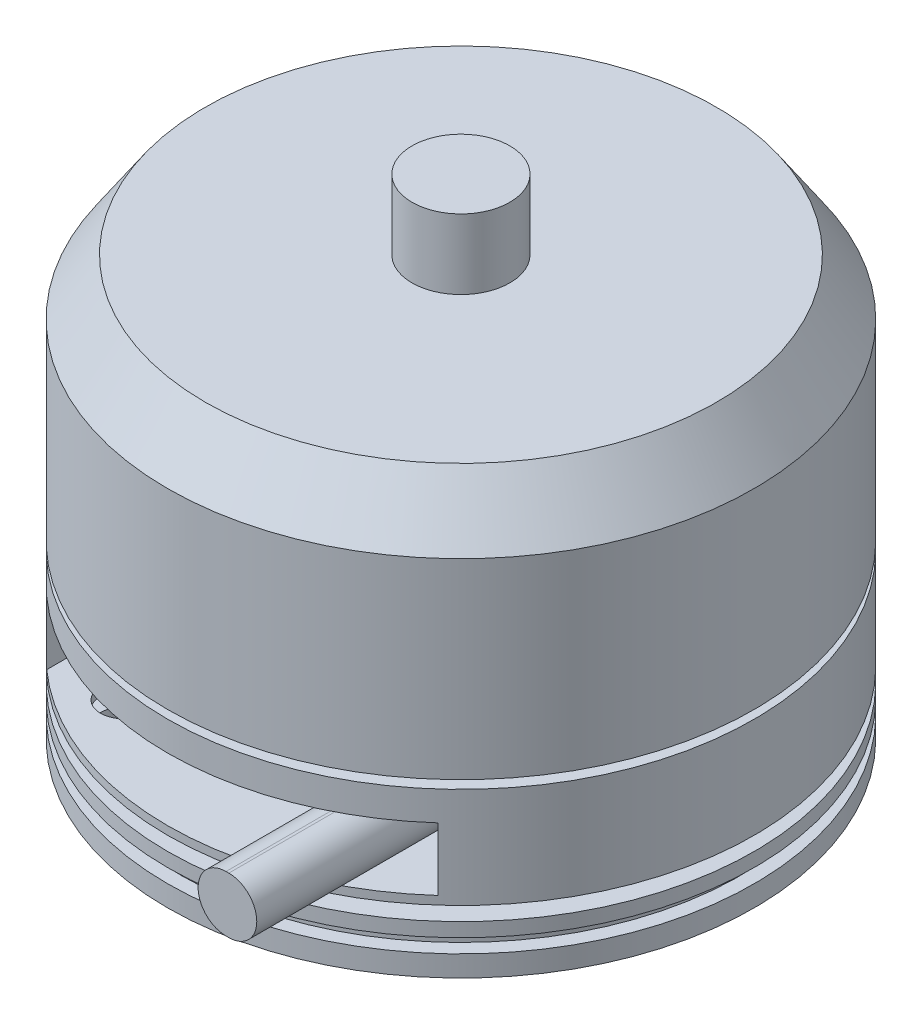
ISO-10303-21;
HEADER;
FILE_DESCRIPTION(('STEP AP214'),'2;1');
FILE_NAME('part.step','',(''),(''),'','','');
FILE_SCHEMA(('AUTOMOTIVE_DESIGN { 1 0 10303 214 1 1 1 1 }'));
ENDSEC;
DATA;
#1=APPLICATION_CONTEXT('core data for automotive mechanical design processes');
#2=APPLICATION_PROTOCOL_DEFINITION('international standard','automotive_design',2000,#1);
#3=PRODUCT_CONTEXT('',#1,'mechanical');
#4=PRODUCT('Part','Part','',(#3));
#5=PRODUCT_RELATED_PRODUCT_CATEGORY('part','',(#4));
#6=PRODUCT_DEFINITION_FORMATION('','',#4);
#7=PRODUCT_DEFINITION_CONTEXT('part definition',#1,'design');
#8=PRODUCT_DEFINITION('design','',#6,#7);
#9=PRODUCT_DEFINITION_SHAPE('','',#8);
#10=(LENGTH_UNIT() NAMED_UNIT(*) SI_UNIT(.MILLI.,.METRE.));
#11=(NAMED_UNIT(*) PLANE_ANGLE_UNIT() SI_UNIT($,.RADIAN.));
#12=(NAMED_UNIT(*) SI_UNIT($,.STERADIAN.) SOLID_ANGLE_UNIT());
#13=UNCERTAINTY_MEASURE_WITH_UNIT(LENGTH_MEASURE(1.E-05),#10,'distance_accuracy_value','');
#14=(GEOMETRIC_REPRESENTATION_CONTEXT(3) GLOBAL_UNCERTAINTY_ASSIGNED_CONTEXT((#13)) GLOBAL_UNIT_ASSIGNED_CONTEXT((#10,
#11,#12)) REPRESENTATION_CONTEXT('',''));
#15=CARTESIAN_POINT('',(0.,0.,0.));
#16=DIRECTION('',(0.,0.,1.));
#17=DIRECTION('',(1.,0.,0.));
#18=AXIS2_PLACEMENT_3D('',#15,#16,#17);
#19=CARTESIAN_POINT('',(13.4,8.7,0.));
#20=DIRECTION('',(0.,1.,0.));
#21=DIRECTION('',(0.,0.,1.));
#22=AXIS2_PLACEMENT_3D('',#19,#20,#21);
#23=PLANE('',#22);
#24=CARTESIAN_POINT('',(9.36869611910201,8.7,-14.7809855228913));
#25=DIRECTION('',(0.,-1.,0.));
#26=DIRECTION('',(0.,0.,-1.));
#27=AXIS2_PLACEMENT_3D('',#24,#25,#26);
#28=CIRCLE('',#27,1.64999999999999);
#29=CARTESIAN_POINT('',(9.36869611910201,8.7,-16.4309855228913));
#30=VERTEX_POINT('',#29);
#31=EDGE_CURVE('E150',#30,#30,#28,.T.);
#32=ORIENTED_EDGE('',*,*,#31,.F.);
#33=EDGE_LOOP('',(#32));
#34=FACE_BOUND('',#33,.T.);
#35=CARTESIAN_POINT('',(14.7809855228913,8.7,9.36869611910201));
#36=DIRECTION('',(0.,-1.,0.));
#37=DIRECTION('',(0.,0.,-1.));
#38=AXIS2_PLACEMENT_3D('',#35,#36,#37);
#39=CIRCLE('',#38,1.64999999999999);
#40=CARTESIAN_POINT('',(14.7809855228913,8.7,7.71869611910202));
#41=VERTEX_POINT('',#40);
#42=EDGE_CURVE('E160',#41,#41,#39,.T.);
#43=ORIENTED_EDGE('',*,*,#42,.F.);
#44=EDGE_LOOP('',(#43));
#45=FACE_BOUND('',#44,.T.);
#46=CARTESIAN_POINT('',(0.,8.7,0.));
#47=DIRECTION('',(0.,1.,0.));
#48=DIRECTION('',(0.,0.,1.));
#49=AXIS2_PLACEMENT_3D('',#46,#47,#48);
#50=CIRCLE('',#49,21.);
#51=CARTESIAN_POINT('',(0.,8.7,21.));
#52=VERTEX_POINT('',#51);
#53=EDGE_CURVE('E269',#52,#52,#50,.T.);
#54=ORIENTED_EDGE('',*,*,#53,.F.);
#55=EDGE_LOOP('',(#54));
#56=FACE_BOUND('',#55,.T.);
#57=CARTESIAN_POINT('',(0.,8.7,0.));
#58=DIRECTION('',(0.,1.,0.));
#59=DIRECTION('',(0.,0.,1.));
#60=AXIS2_PLACEMENT_3D('',#57,#58,#59);
#61=CIRCLE('',#60,13.4);
#62=CARTESIAN_POINT('',(0.,8.7,13.4));
#63=VERTEX_POINT('',#62);
#64=EDGE_CURVE('E272',#63,#63,#61,.T.);
#65=ORIENTED_EDGE('',*,*,#64,.T.);
#66=EDGE_LOOP('',(#65));
#67=FACE_BOUND('',#66,.T.);
#68=CARTESIAN_POINT('',(-9.36869611910201,8.7,14.7809855228913));
#69=DIRECTION('',(0.,-1.,0.));
#70=DIRECTION('',(0.,0.,-1.));
#71=AXIS2_PLACEMENT_3D('',#68,#69,#70);
#72=CIRCLE('',#71,1.64999999999999);
#73=CARTESIAN_POINT('',(-9.36869611910201,8.7,13.1309855228913));
#74=VERTEX_POINT('',#73);
#75=EDGE_CURVE('E134',#74,#74,#72,.T.);
#76=ORIENTED_EDGE('',*,*,#75,.F.);
#77=EDGE_LOOP('',(#76));
#78=FACE_BOUND('',#77,.T.);
#79=CARTESIAN_POINT('',(-14.7809855228913,8.7,-9.36869611910201));
#80=DIRECTION('',(0.,-1.,0.));
#81=DIRECTION('',(0.,0.,-1.));
#82=AXIS2_PLACEMENT_3D('',#79,#80,#81);
#83=CIRCLE('',#82,1.64999999999999);
#84=CARTESIAN_POINT('',(-14.7809855228913,8.7,-11.018696119102));
#85=VERTEX_POINT('',#84);
#86=EDGE_CURVE('E125',#85,#85,#83,.T.);
#87=ORIENTED_EDGE('',*,*,#86,.F.);
#88=EDGE_LOOP('',(#87));
#89=FACE_BOUND('',#88,.T.);
#90=ADVANCED_FACE('F38',(#34,#45,#56,#67,#78,#89),#23,.F.);
#91=CARTESIAN_POINT('',(0.,0.,11.));
#92=DIRECTION('',(0.,0.,1.));
#93=DIRECTION('',(1.,0.,0.));
#94=AXIS2_PLACEMENT_3D('',#91,#92,#93);
#95=PLANE('',#94);
#96=DIRECTION('',(0.,1.,0.));
#97=VECTOR('',#96,1.);
#98=CARTESIAN_POINT('',(14.,18.3,11.));
#99=LINE('',#98,#97);
#100=CARTESIAN_POINT('',(14.,13.8,11.));
#101=VERTEX_POINT('',#100);
#102=CARTESIAN_POINT('',(14.,18.3,11.));
#103=VERTEX_POINT('',#102);
#104=EDGE_CURVE('E199',#101,#103,#99,.T.);
#105=ORIENTED_EDGE('',*,*,#104,.T.);
#106=DIRECTION('',(-1.,0.,0.));
#107=VECTOR('',#106,1.);
#108=CARTESIAN_POINT('',(-14.,18.3,11.));
#109=LINE('',#108,#107);
#110=CARTESIAN_POINT('',(-14.,18.3,11.));
#111=VERTEX_POINT('',#110);
#112=EDGE_CURVE('E202',#103,#111,#109,.T.);
#113=ORIENTED_EDGE('',*,*,#112,.T.);
#114=DIRECTION('',(0.,-1.,0.));
#115=VECTOR('',#114,1.);
#116=CARTESIAN_POINT('',(-14.,18.3,11.));
#117=LINE('',#116,#115);
#118=CARTESIAN_POINT('',(-14.,13.8,11.));
#119=VERTEX_POINT('',#118);
#120=EDGE_CURVE('E205',#111,#119,#117,.T.);
#121=ORIENTED_EDGE('',*,*,#120,.T.);
#122=DIRECTION('',(1.,0.,0.));
#123=VECTOR('',#122,1.);
#124=CARTESIAN_POINT('',(-14.,13.8,11.));
#125=LINE('',#124,#123);
#126=EDGE_CURVE('E208',#119,#101,#125,.T.);
#127=ORIENTED_EDGE('',*,*,#126,.T.);
#128=EDGE_LOOP('',(#105,#113,#121,#127));
#129=FACE_BOUND('',#128,.T.);
#130=DIRECTION('',(1.,0.,0.));
#131=VECTOR('',#130,1.);
#132=CARTESIAN_POINT('',(9.18505632343501,14.0531944170925,11.));
#133=LINE('',#132,#131);
#134=CARTESIAN_POINT('',(9.18505632343501,14.0531944170925,11.));
#135=VERTEX_POINT('',#134);
#136=CARTESIAN_POINT('',(9.38505632343501,14.0531944170925,11.));
#137=VERTEX_POINT('',#136);
#138=EDGE_CURVE('E186',#135,#137,#133,.T.);
#139=ORIENTED_EDGE('',*,*,#138,.F.);
#140=CARTESIAN_POINT('',(9.18505632343501,16.0531944170925,11.));
#141=DIRECTION('',(0.,0.,1.));
#142=DIRECTION('',(1.,0.,0.));
#143=AXIS2_PLACEMENT_3D('',#140,#141,#142);
#144=CIRCLE('',#143,1.99999999999999);
#145=CARTESIAN_POINT('',(9.18505632343501,18.0531944170925,11.));
#146=VERTEX_POINT('',#145);
#147=EDGE_CURVE('E172',#146,#135,#144,.T.);
#148=ORIENTED_EDGE('',*,*,#147,.F.);
#149=DIRECTION('',(-1.,0.,0.));
#150=VECTOR('',#149,1.);
#151=CARTESIAN_POINT('',(9.18505632343501,18.0531944170925,11.));
#152=LINE('',#151,#150);
#153=CARTESIAN_POINT('',(9.38505632343501,18.0531944170925,11.));
#154=VERTEX_POINT('',#153);
#155=EDGE_CURVE('E177',#154,#146,#152,.T.);
#156=ORIENTED_EDGE('',*,*,#155,.F.);
#157=CARTESIAN_POINT('',(9.38505632343501,16.0531944170925,11.));
#158=DIRECTION('',(0.,0.,1.));
#159=DIRECTION('',(1.,0.,0.));
#160=AXIS2_PLACEMENT_3D('',#157,#158,#159);
#161=CIRCLE('',#160,2.);
#162=EDGE_CURVE('E188',#137,#154,#161,.T.);
#163=ORIENTED_EDGE('',*,*,#162,.F.);
#164=EDGE_LOOP('',(#139,#148,#156,#163));
#165=FACE_BOUND('',#164,.T.);
#166=ADVANCED_FACE('F317',(#129,#165),#95,.T.);
#167=CARTESIAN_POINT('',(0.,0.,0.));
#168=DIRECTION('',(0.,1.,0.));
#169=DIRECTION('',(0.,0.,1.));
#170=AXIS2_PLACEMENT_3D('',#167,#168,#169);
#171=PLANE('',#170);
#172=CARTESIAN_POINT('',(0.,0.,0.));
#173=DIRECTION('',(0.,1.,0.));
#174=DIRECTION('',(0.,0.,1.));
#175=AXIS2_PLACEMENT_3D('',#172,#173,#174);
#176=CIRCLE('',#175,4.1);
#177=CARTESIAN_POINT('',(0.,0.,4.1));
#178=VERTEX_POINT('',#177);
#179=EDGE_CURVE('E281',#178,#178,#176,.T.);
#180=ORIENTED_EDGE('',*,*,#179,.F.);
#181=EDGE_LOOP('',(#180));
#182=FACE_BOUND('',#181,.T.);
#183=ADVANCED_FACE('F40',(#182),#171,.F.);
#184=CARTESIAN_POINT('',(0.,43.7,0.));
#185=DIRECTION('',(0.,1.,0.));
#186=DIRECTION('',(0.,0.,1.));
#187=AXIS2_PLACEMENT_3D('',#184,#185,#186);
#188=CYLINDRICAL_SURFACE('',#187,4.1);
#189=CARTESIAN_POINT('',(0.,6.7,0.));
#190=DIRECTION('',(0.,1.,0.));
#191=DIRECTION('',(0.,0.,1.));
#192=AXIS2_PLACEMENT_3D('',#189,#190,#191);
#193=CIRCLE('',#192,4.1);
#194=CARTESIAN_POINT('',(0.,6.7,4.1));
#195=VERTEX_POINT('',#194);
#196=EDGE_CURVE('E278',#195,#195,#193,.T.);
#197=ORIENTED_EDGE('',*,*,#196,.F.);
#198=EDGE_LOOP('',(#197));
#199=FACE_BOUND('',#198,.T.);
#200=ORIENTED_EDGE('',*,*,#179,.T.);
#201=EDGE_LOOP('',(#200));
#202=FACE_BOUND('',#201,.T.);
#203=ADVANCED_FACE('F337',(#199,#202),#188,.T.);
#204=CARTESIAN_POINT('',(4.1,6.7,0.));
#205=DIRECTION('',(0.,1.,0.));
#206=DIRECTION('',(0.,0.,1.));
#207=AXIS2_PLACEMENT_3D('',#204,#205,#206);
#208=PLANE('',#207);
#209=CARTESIAN_POINT('',(0.,6.7,0.));
#210=DIRECTION('',(0.,1.,0.));
#211=DIRECTION('',(0.,0.,1.));
#212=AXIS2_PLACEMENT_3D('',#209,#210,#211);
#213=CIRCLE('',#212,13.4);
#214=CARTESIAN_POINT('',(0.,6.7,13.4));
#215=VERTEX_POINT('',#214);
#216=EDGE_CURVE('E275',#215,#215,#213,.T.);
#217=ORIENTED_EDGE('',*,*,#216,.F.);
#218=EDGE_LOOP('',(#217));
#219=FACE_BOUND('',#218,.T.);
#220=ORIENTED_EDGE('',*,*,#196,.T.);
#221=EDGE_LOOP('',(#220));
#222=FACE_BOUND('',#221,.T.);
#223=ADVANCED_FACE('F334',(#219,#222),#208,.F.);
#224=CARTESIAN_POINT('',(0.,43.7,0.));
#225=DIRECTION('',(0.,1.,0.));
#226=DIRECTION('',(0.,0.,1.));
#227=AXIS2_PLACEMENT_3D('',#224,#225,#226);
#228=CYLINDRICAL_SURFACE('',#227,13.4);
#229=ORIENTED_EDGE('',*,*,#64,.F.);
#230=EDGE_LOOP('',(#229));
#231=FACE_BOUND('',#230,.T.);
#232=ORIENTED_EDGE('',*,*,#216,.T.);
#233=EDGE_LOOP('',(#232));
#234=FACE_BOUND('',#233,.T.);
#235=ADVANCED_FACE('F331',(#231,#234),#228,.T.);
#236=CARTESIAN_POINT('',(0.,43.7,0.));
#237=DIRECTION('',(0.,1.,0.));
#238=DIRECTION('',(0.,0.,1.));
#239=AXIS2_PLACEMENT_3D('',#236,#237,#238);
#240=CYLINDRICAL_SURFACE('',#239,21.);
#241=CARTESIAN_POINT('',(0.,10.2,0.));
#242=DIRECTION('',(0.,1.,0.));
#243=DIRECTION('',(0.,0.,1.));
#244=AXIS2_PLACEMENT_3D('',#241,#242,#243);
#245=CIRCLE('',#244,21.);
#246=CARTESIAN_POINT('',(0.,10.2,21.));
#247=VERTEX_POINT('',#246);
#248=EDGE_CURVE('E266',#247,#247,#245,.T.);
#249=ORIENTED_EDGE('',*,*,#248,.F.);
#250=EDGE_LOOP('',(#249));
#251=FACE_BOUND('',#250,.T.);
#252=ORIENTED_EDGE('',*,*,#53,.T.);
#253=EDGE_LOOP('',(#252));
#254=FACE_BOUND('',#253,.T.);
#255=ADVANCED_FACE('F329',(#251,#254),#240,.T.);
#256=CARTESIAN_POINT('',(21.,10.2,0.));
#257=DIRECTION('',(0.,-1.,0.));
#258=DIRECTION('',(0.,0.,-1.));
#259=AXIS2_PLACEMENT_3D('',#256,#257,#258);
#260=PLANE('',#259);
#261=CARTESIAN_POINT('',(0.,10.2,0.));
#262=DIRECTION('',(0.,1.,0.));
#263=DIRECTION('',(0.,0.,1.));
#264=AXIS2_PLACEMENT_3D('',#261,#262,#263);
#265=CIRCLE('',#264,20.);
#266=CARTESIAN_POINT('',(0.,10.2,20.));
#267=VERTEX_POINT('',#266);
#268=EDGE_CURVE('E263',#267,#267,#265,.T.);
#269=ORIENTED_EDGE('',*,*,#268,.F.);
#270=EDGE_LOOP('',(#269));
#271=FACE_BOUND('',#270,.T.);
#272=ORIENTED_EDGE('',*,*,#248,.T.);
#273=EDGE_LOOP('',(#272));
#274=FACE_BOUND('',#273,.T.);
#275=ADVANCED_FACE('F706',(#271,#274),#260,.F.);
#276=CARTESIAN_POINT('',(0.,43.7,0.));
#277=DIRECTION('',(0.,1.,0.));
#278=DIRECTION('',(0.,0.,1.));
#279=AXIS2_PLACEMENT_3D('',#276,#277,#278);
#280=CYLINDRICAL_SURFACE('',#279,20.);
#281=CARTESIAN_POINT('',(0.,11.2,0.));
#282=DIRECTION('',(0.,1.,0.));
#283=DIRECTION('',(0.,0.,1.));
#284=AXIS2_PLACEMENT_3D('',#281,#282,#283);
#285=CIRCLE('',#284,20.);
#286=CARTESIAN_POINT('',(0.,11.2,20.));
#287=VERTEX_POINT('',#286);
#288=EDGE_CURVE('E260',#287,#287,#285,.T.);
#289=ORIENTED_EDGE('',*,*,#288,.F.);
#290=EDGE_LOOP('',(#289));
#291=FACE_BOUND('',#290,.T.);
#292=ORIENTED_EDGE('',*,*,#268,.T.);
#293=EDGE_LOOP('',(#292));
#294=FACE_BOUND('',#293,.T.);
#295=ADVANCED_FACE('F703',(#291,#294),#280,.T.);
#296=CARTESIAN_POINT('',(20.,11.2,0.));
#297=DIRECTION('',(0.,1.,0.));
#298=DIRECTION('',(0.,0.,1.));
#299=AXIS2_PLACEMENT_3D('',#296,#297,#298);
#300=PLANE('',#299);
#301=CARTESIAN_POINT('',(0.,11.2,0.));
#302=DIRECTION('',(0.,1.,0.));
#303=DIRECTION('',(0.,0.,1.));
#304=AXIS2_PLACEMENT_3D('',#301,#302,#303);
#305=CIRCLE('',#304,21.);
#306=CARTESIAN_POINT('',(0.,11.2,21.));
#307=VERTEX_POINT('',#306);
#308=EDGE_CURVE('E257',#307,#307,#305,.T.);
#309=ORIENTED_EDGE('',*,*,#308,.F.);
#310=EDGE_LOOP('',(#309));
#311=FACE_BOUND('',#310,.T.);
#312=ORIENTED_EDGE('',*,*,#288,.T.);
#313=EDGE_LOOP('',(#312));
#314=FACE_BOUND('',#313,.T.);
#315=ADVANCED_FACE('F699',(#311,#314),#300,.F.);
#316=CARTESIAN_POINT('',(0.,43.7,0.));
#317=DIRECTION('',(0.,1.,0.));
#318=DIRECTION('',(0.,0.,1.));
#319=AXIS2_PLACEMENT_3D('',#316,#317,#318);
#320=CYLINDRICAL_SURFACE('',#319,21.);
#321=CARTESIAN_POINT('',(0.,12.2,0.));
#322=DIRECTION('',(0.,1.,0.));
#323=DIRECTION('',(0.,0.,1.));
#324=AXIS2_PLACEMENT_3D('',#321,#322,#323);
#325=CIRCLE('',#324,21.);
#326=CARTESIAN_POINT('',(0.,12.2,21.));
#327=VERTEX_POINT('',#326);
#328=EDGE_CURVE('E254',#327,#327,#325,.T.);
#329=ORIENTED_EDGE('',*,*,#328,.F.);
#330=EDGE_LOOP('',(#329));
#331=FACE_BOUND('',#330,.T.);
#332=ORIENTED_EDGE('',*,*,#308,.T.);
#333=EDGE_LOOP('',(#332));
#334=FACE_BOUND('',#333,.T.);
#335=ADVANCED_FACE('F431',(#331,#334),#320,.T.);
#336=CARTESIAN_POINT('',(21.,12.2,0.));
#337=DIRECTION('',(0.,-1.,0.));
#338=DIRECTION('',(0.,0.,-1.));
#339=AXIS2_PLACEMENT_3D('',#336,#337,#338);
#340=PLANE('',#339);
#341=CARTESIAN_POINT('',(-14.7809855228913,12.2,-9.36869611910201));
#342=DIRECTION('',(0.,-1.,0.));
#343=DIRECTION('',(0.,0.,-1.));
#344=AXIS2_PLACEMENT_3D('',#341,#342,#343);
#345=CIRCLE('',#344,1.64999999999999);
#346=CARTESIAN_POINT('',(-14.7809855228913,12.2,-11.018696119102));
#347=VERTEX_POINT('',#346);
#348=EDGE_CURVE('E42',#347,#347,#345,.T.);
#349=ORIENTED_EDGE('',*,*,#348,.T.);
#350=EDGE_LOOP('',(#349));
#351=FACE_BOUND('',#350,.T.);
#352=CARTESIAN_POINT('',(-9.36869611910201,12.2,14.7809855228913));
#353=DIRECTION('',(0.,-1.,0.));
#354=DIRECTION('',(0.,0.,-1.));
#355=AXIS2_PLACEMENT_3D('',#352,#353,#354);
#356=CIRCLE('',#355,1.64999999999999);
#357=CARTESIAN_POINT('',(-9.36869611910201,12.2,13.1309855228913));
#358=VERTEX_POINT('',#357);
#359=EDGE_CURVE('E147',#358,#358,#356,.T.);
#360=ORIENTED_EDGE('',*,*,#359,.T.);
#361=EDGE_LOOP('',(#360));
#362=FACE_BOUND('',#361,.T.);
#363=CARTESIAN_POINT('',(9.36869611910201,12.2,-14.7809855228913));
#364=DIRECTION('',(0.,-1.,0.));
#365=DIRECTION('',(0.,0.,-1.));
#366=AXIS2_PLACEMENT_3D('',#363,#364,#365);
#367=CIRCLE('',#366,1.64999999999999);
#368=CARTESIAN_POINT('',(9.36869611910201,12.2,-16.4309855228913));
#369=VERTEX_POINT('',#368);
#370=EDGE_CURVE('E157',#369,#369,#367,.T.);
#371=ORIENTED_EDGE('',*,*,#370,.T.);
#372=EDGE_LOOP('',(#371));
#373=FACE_BOUND('',#372,.T.);
#374=CARTESIAN_POINT('',(14.7809855228913,12.2,9.36869611910201));
#375=DIRECTION('',(0.,-1.,0.));
#376=DIRECTION('',(0.,0.,-1.));
#377=AXIS2_PLACEMENT_3D('',#374,#375,#376);
#378=CIRCLE('',#377,1.64999999999999);
#379=CARTESIAN_POINT('',(14.7809855228913,12.2,7.71869611910202));
#380=VERTEX_POINT('',#379);
#381=EDGE_CURVE('E166',#380,#380,#378,.T.);
#382=ORIENTED_EDGE('',*,*,#381,.T.);
#383=EDGE_LOOP('',(#382));
#384=FACE_BOUND('',#383,.T.);
#385=CARTESIAN_POINT('',(0.,12.2,0.));
#386=DIRECTION('',(0.,1.,0.));
#387=DIRECTION('',(0.,0.,1.));
#388=AXIS2_PLACEMENT_3D('',#385,#386,#387);
#389=CIRCLE('',#388,10.);
#390=CARTESIAN_POINT('',(0.,12.2,10.));
#391=VERTEX_POINT('',#390);
#392=EDGE_CURVE('E251',#391,#391,#389,.T.);
#393=ORIENTED_EDGE('',*,*,#392,.F.);
#394=EDGE_LOOP('',(#393));
#395=FACE_BOUND('',#394,.T.);
#396=ORIENTED_EDGE('',*,*,#328,.T.);
#397=EDGE_LOOP('',(#396));
#398=FACE_BOUND('',#397,.T.);
#399=ADVANCED_FACE('F425',(#351,#362,#373,#384,#395,#398),#340,.F.);
#400=CARTESIAN_POINT('',(0.,43.7,0.));
#401=DIRECTION('',(0.,1.,0.));
#402=DIRECTION('',(0.,0.,1.));
#403=AXIS2_PLACEMENT_3D('',#400,#401,#402);
#404=CYLINDRICAL_SURFACE('',#403,10.);
#405=CARTESIAN_POINT('',(0.,13.2,0.));
#406=DIRECTION('',(0.,1.,0.));
#407=DIRECTION('',(0.,0.,1.));
#408=AXIS2_PLACEMENT_3D('',#405,#406,#407);
#409=CIRCLE('',#408,10.);
#410=CARTESIAN_POINT('',(0.,13.2,10.));
#411=VERTEX_POINT('',#410);
#412=EDGE_CURVE('E248',#411,#411,#409,.T.);
#413=ORIENTED_EDGE('',*,*,#412,.F.);
#414=EDGE_LOOP('',(#413));
#415=FACE_BOUND('',#414,.T.);
#416=ORIENTED_EDGE('',*,*,#392,.T.);
#417=EDGE_LOOP('',(#416));
#418=FACE_BOUND('',#417,.T.);
#419=ADVANCED_FACE('F430',(#415,#418),#404,.T.);
#420=CARTESIAN_POINT('',(10.,13.2,0.));
#421=DIRECTION('',(0.,1.,0.));
#422=DIRECTION('',(0.,0.,1.));
#423=AXIS2_PLACEMENT_3D('',#420,#421,#422);
#424=PLANE('',#423);
#425=CARTESIAN_POINT('',(-14.7809855228913,13.2,-9.36869611910201));
#426=DIRECTION('',(0.,1.,0.));
#427=DIRECTION('',(0.,0.,1.));
#428=AXIS2_PLACEMENT_3D('',#425,#426,#427);
#429=CIRCLE('',#428,1.64999999999999);
#430=CARTESIAN_POINT('',(-14.7809855228913,13.2,-7.71869611910202));
#431=VERTEX_POINT('',#430);
#432=EDGE_CURVE('E128',#431,#431,#429,.T.);
#433=ORIENTED_EDGE('',*,*,#432,.T.);
#434=EDGE_LOOP('',(#433));
#435=FACE_BOUND('',#434,.T.);
#436=CARTESIAN_POINT('',(-9.36869611910201,13.2,14.7809855228913));
#437=DIRECTION('',(0.,1.,0.));
#438=DIRECTION('',(0.,0.,1.));
#439=AXIS2_PLACEMENT_3D('',#436,#437,#438);
#440=CIRCLE('',#439,1.64999999999999);
#441=CARTESIAN_POINT('',(-9.36869611910201,13.2,16.4309855228913));
#442=VERTEX_POINT('',#441);
#443=EDGE_CURVE('E144',#442,#442,#440,.T.);
#444=ORIENTED_EDGE('',*,*,#443,.T.);
#445=EDGE_LOOP('',(#444));
#446=FACE_BOUND('',#445,.T.);
#447=CARTESIAN_POINT('',(9.36869611910201,13.2,-14.7809855228913));
#448=DIRECTION('',(0.,1.,0.));
#449=DIRECTION('',(0.,0.,1.));
#450=AXIS2_PLACEMENT_3D('',#447,#448,#449);
#451=CIRCLE('',#450,1.64999999999999);
#452=CARTESIAN_POINT('',(9.36869611910201,13.2,-13.1309855228913));
#453=VERTEX_POINT('',#452);
#454=EDGE_CURVE('E156',#453,#453,#451,.T.);
#455=ORIENTED_EDGE('',*,*,#454,.T.);
#456=EDGE_LOOP('',(#455));
#457=FACE_BOUND('',#456,.T.);
#458=CARTESIAN_POINT('',(14.7809855228913,13.2,9.36869611910201));
#459=DIRECTION('',(0.,1.,0.));
#460=DIRECTION('',(0.,0.,1.));
#461=AXIS2_PLACEMENT_3D('',#458,#459,#460);
#462=CIRCLE('',#461,1.64999999999999);
#463=CARTESIAN_POINT('',(14.7809855228913,13.2,11.018696119102));
#464=VERTEX_POINT('',#463);
#465=EDGE_CURVE('E169',#464,#464,#462,.T.);
#466=ORIENTED_EDGE('',*,*,#465,.T.);
#467=EDGE_LOOP('',(#466));
#468=FACE_BOUND('',#467,.T.);
#469=CARTESIAN_POINT('',(0.,13.2,0.));
#470=DIRECTION('',(0.,1.,0.));
#471=DIRECTION('',(0.,0.,1.));
#472=AXIS2_PLACEMENT_3D('',#469,#470,#471);
#473=CIRCLE('',#472,21.);
#474=CARTESIAN_POINT('',(0.,13.2,21.));
#475=VERTEX_POINT('',#474);
#476=EDGE_CURVE('E245',#475,#475,#473,.T.);
#477=ORIENTED_EDGE('',*,*,#476,.F.);
#478=EDGE_LOOP('',(#477));
#479=FACE_BOUND('',#478,.T.);
#480=ORIENTED_EDGE('',*,*,#412,.T.);
#481=EDGE_LOOP('',(#480));
#482=FACE_BOUND('',#481,.T.);
#483=ADVANCED_FACE('F441',(#435,#446,#457,#468,#479,#482),#424,.F.);
#484=CARTESIAN_POINT('',(0.,43.7,0.));
#485=DIRECTION('',(0.,1.,0.));
#486=DIRECTION('',(0.,0.,1.));
#487=AXIS2_PLACEMENT_3D('',#484,#485,#486);
#488=CYLINDRICAL_SURFACE('',#487,21.);
#489=CARTESIAN_POINT('',(0.,18.3,0.));
#490=DIRECTION('',(0.,1.,0.));
#491=DIRECTION('',(0.,0.,1.));
#492=AXIS2_PLACEMENT_3D('',#489,#490,#491);
#493=CIRCLE('',#492,21.);
#494=CARTESIAN_POINT('',(-14.,18.3,15.6524758424985));
#495=VERTEX_POINT('',#494);
#496=CARTESIAN_POINT('',(14.,18.3,15.6524758424985));
#497=VERTEX_POINT('',#496);
#498=EDGE_CURVE('E284',#495,#497,#493,.T.);
#499=ORIENTED_EDGE('',*,*,#498,.T.);
#500=DIRECTION('',(0.,1.,0.));
#501=VECTOR('',#500,1.);
#502=CARTESIAN_POINT('',(14.,43.7,15.6524758424985));
#503=LINE('',#502,#501);
#504=CARTESIAN_POINT('',(14.,13.8,15.6524758424985));
#505=VERTEX_POINT('',#504);
#506=EDGE_CURVE('E11',#497,#505,#503,.F.);
#507=ORIENTED_EDGE('',*,*,#506,.T.);
#508=CARTESIAN_POINT('',(0.,13.8,0.));
#509=DIRECTION('',(0.,-1.,0.));
#510=DIRECTION('',(0.,0.,-1.));
#511=AXIS2_PLACEMENT_3D('',#508,#509,#510);
#512=CIRCLE('',#511,21.);
#513=CARTESIAN_POINT('',(-14.,13.8,15.6524758424985));
#514=VERTEX_POINT('',#513);
#515=EDGE_CURVE('E47',#505,#514,#512,.T.);
#516=ORIENTED_EDGE('',*,*,#515,.T.);
#517=DIRECTION('',(0.,1.,0.));
#518=VECTOR('',#517,1.);
#519=CARTESIAN_POINT('',(-14.,43.7,15.6524758424985));
#520=LINE('',#519,#518);
#521=EDGE_CURVE('E286',#514,#495,#520,.T.);
#522=ORIENTED_EDGE('',*,*,#521,.T.);
#523=EDGE_LOOP('',(#499,#507,#516,#522));
#524=FACE_BOUND('',#523,.T.);
#525=CARTESIAN_POINT('',(0.,20.4,0.));
#526=DIRECTION('',(0.,1.,0.));
#527=DIRECTION('',(0.,0.,1.));
#528=AXIS2_PLACEMENT_3D('',#525,#526,#527);
#529=CIRCLE('',#528,21.);
#530=CARTESIAN_POINT('',(0.,20.4,21.));
#531=VERTEX_POINT('',#530);
#532=EDGE_CURVE('E242',#531,#531,#529,.T.);
#533=ORIENTED_EDGE('',*,*,#532,.F.);
#534=EDGE_LOOP('',(#533));
#535=FACE_BOUND('',#534,.T.);
#536=ORIENTED_EDGE('',*,*,#476,.T.);
#537=EDGE_LOOP('',(#536));
#538=FACE_BOUND('',#537,.T.);
#539=ADVANCED_FACE('F446',(#524,#535,#538),#488,.T.);
#540=CARTESIAN_POINT('',(21.,20.4,0.));
#541=DIRECTION('',(0.,-1.,0.));
#542=DIRECTION('',(0.,0.,-1.));
#543=AXIS2_PLACEMENT_3D('',#540,#541,#542);
#544=PLANE('',#543);
#545=CARTESIAN_POINT('',(0.,20.4,0.));
#546=DIRECTION('',(0.,1.,0.));
#547=DIRECTION('',(0.,0.,1.));
#548=AXIS2_PLACEMENT_3D('',#545,#546,#547);
#549=CIRCLE('',#548,5.);
#550=CARTESIAN_POINT('',(0.,20.4,5.));
#551=VERTEX_POINT('',#550);
#552=EDGE_CURVE('E239',#551,#551,#549,.T.);
#553=ORIENTED_EDGE('',*,*,#552,.F.);
#554=EDGE_LOOP('',(#553));
#555=FACE_BOUND('',#554,.T.);
#556=ORIENTED_EDGE('',*,*,#532,.T.);
#557=EDGE_LOOP('',(#556));
#558=FACE_BOUND('',#557,.T.);
#559=ADVANCED_FACE('F624',(#555,#558),#544,.F.);
#560=CARTESIAN_POINT('',(0.,43.7,0.));
#561=DIRECTION('',(0.,1.,0.));
#562=DIRECTION('',(0.,0.,1.));
#563=AXIS2_PLACEMENT_3D('',#560,#561,#562);
#564=CYLINDRICAL_SURFACE('',#563,5.);
#565=CARTESIAN_POINT('',(0.,21.,0.));
#566=DIRECTION('',(0.,1.,0.));
#567=DIRECTION('',(0.,0.,1.));
#568=AXIS2_PLACEMENT_3D('',#565,#566,#567);
#569=CIRCLE('',#568,5.);
#570=CARTESIAN_POINT('',(0.,21.,5.));
#571=VERTEX_POINT('',#570);
#572=EDGE_CURVE('E236',#571,#571,#569,.T.);
#573=ORIENTED_EDGE('',*,*,#572,.F.);
#574=EDGE_LOOP('',(#573));
#575=FACE_BOUND('',#574,.T.);
#576=ORIENTED_EDGE('',*,*,#552,.T.);
#577=EDGE_LOOP('',(#576));
#578=FACE_BOUND('',#577,.T.);
#579=ADVANCED_FACE('F635',(#575,#578),#564,.T.);
#580=CARTESIAN_POINT('',(5.,21.,0.));
#581=DIRECTION('',(0.,1.,0.));
#582=DIRECTION('',(0.,0.,1.));
#583=AXIS2_PLACEMENT_3D('',#580,#581,#582);
#584=PLANE('',#583);
#585=CARTESIAN_POINT('',(0.,21.,0.));
#586=DIRECTION('',(0.,1.,0.));
#587=DIRECTION('',(0.,0.,1.));
#588=AXIS2_PLACEMENT_3D('',#585,#586,#587);
#589=CIRCLE('',#588,21.);
#590=CARTESIAN_POINT('',(0.,21.,21.));
#591=VERTEX_POINT('',#590);
#592=EDGE_CURVE('E233',#591,#591,#589,.T.);
#593=ORIENTED_EDGE('',*,*,#592,.F.);
#594=EDGE_LOOP('',(#593));
#595=FACE_BOUND('',#594,.T.);
#596=ORIENTED_EDGE('',*,*,#572,.T.);
#597=EDGE_LOOP('',(#596));
#598=FACE_BOUND('',#597,.T.);
#599=ADVANCED_FACE('F643',(#595,#598),#584,.F.);
#600=CARTESIAN_POINT('',(0.,43.7,0.));
#601=DIRECTION('',(0.,1.,0.));
#602=DIRECTION('',(0.,0.,1.));
#603=AXIS2_PLACEMENT_3D('',#600,#601,#602);
#604=CYLINDRICAL_SURFACE('',#603,21.);
#605=CARTESIAN_POINT('',(0.,34.7,0.));
#606=DIRECTION('',(0.,1.,0.));
#607=DIRECTION('',(0.,0.,1.));
#608=AXIS2_PLACEMENT_3D('',#605,#606,#607);
#609=CIRCLE('',#608,21.);
#610=CARTESIAN_POINT('',(0.,34.7,21.));
#611=VERTEX_POINT('',#610);
#612=EDGE_CURVE('E230',#611,#611,#609,.T.);
#613=ORIENTED_EDGE('',*,*,#612,.F.);
#614=EDGE_LOOP('',(#613));
#615=FACE_BOUND('',#614,.T.);
#616=ORIENTED_EDGE('',*,*,#592,.T.);
#617=EDGE_LOOP('',(#616));
#618=FACE_BOUND('',#617,.T.);
#619=ADVANCED_FACE('F651',(#615,#618),#604,.T.);
#620=CARTESIAN_POINT('',(0.,34.7,0.));
#621=DIRECTION('',(0.,-1.,0.));
#622=DIRECTION('',(0.,0.,-1.));
#623=AXIS2_PLACEMENT_3D('',#620,#621,#622);
#624=CONICAL_SURFACE('',#623,21.,0.593749666710772);
#625=CARTESIAN_POINT('',(0.,38.7,0.));
#626=DIRECTION('',(0.,1.,0.));
#627=DIRECTION('',(0.,0.,1.));
#628=AXIS2_PLACEMENT_3D('',#625,#626,#627);
#629=CIRCLE('',#628,18.3);
#630=CARTESIAN_POINT('',(0.,38.7,18.3));
#631=VERTEX_POINT('',#630);
#632=EDGE_CURVE('E227',#631,#631,#629,.T.);
#633=ORIENTED_EDGE('',*,*,#632,.F.);
#634=EDGE_LOOP('',(#633));
#635=FACE_BOUND('',#634,.T.);
#636=ORIENTED_EDGE('',*,*,#612,.T.);
#637=EDGE_LOOP('',(#636));
#638=FACE_BOUND('',#637,.T.);
#639=ADVANCED_FACE('F660',(#635,#638),#624,.T.);
#640=CARTESIAN_POINT('',(18.3,38.7,0.));
#641=DIRECTION('',(0.,-1.,0.));
#642=DIRECTION('',(0.,0.,-1.));
#643=AXIS2_PLACEMENT_3D('',#640,#641,#642);
#644=PLANE('',#643);
#645=CARTESIAN_POINT('',(0.,38.7,0.));
#646=DIRECTION('',(0.,1.,0.));
#647=DIRECTION('',(0.,0.,1.));
#648=AXIS2_PLACEMENT_3D('',#645,#646,#647);
#649=CIRCLE('',#648,3.5);
#650=CARTESIAN_POINT('',(0.,38.7,3.5));
#651=VERTEX_POINT('',#650);
#652=EDGE_CURVE('E224',#651,#651,#649,.T.);
#653=ORIENTED_EDGE('',*,*,#652,.F.);
#654=EDGE_LOOP('',(#653));
#655=FACE_BOUND('',#654,.T.);
#656=ORIENTED_EDGE('',*,*,#632,.T.);
#657=EDGE_LOOP('',(#656));
#658=FACE_BOUND('',#657,.T.);
#659=ADVANCED_FACE('F600',(#655,#658),#644,.F.);
#660=CARTESIAN_POINT('',(0.,43.7,0.));
#661=DIRECTION('',(0.,1.,0.));
#662=DIRECTION('',(0.,0.,1.));
#663=AXIS2_PLACEMENT_3D('',#660,#661,#662);
#664=CYLINDRICAL_SURFACE('',#663,3.5);
#665=CARTESIAN_POINT('',(0.,43.7,0.));
#666=DIRECTION('',(0.,1.,0.));
#667=DIRECTION('',(0.,0.,1.));
#668=AXIS2_PLACEMENT_3D('',#665,#666,#667);
#669=CIRCLE('',#668,3.5);
#670=CARTESIAN_POINT('',(0.,43.7,3.5));
#671=VERTEX_POINT('',#670);
#672=EDGE_CURVE('E214',#671,#671,#669,.T.);
#673=ORIENTED_EDGE('',*,*,#672,.F.);
#674=EDGE_LOOP('',(#673));
#675=FACE_BOUND('',#674,.T.);
#676=ORIENTED_EDGE('',*,*,#652,.T.);
#677=EDGE_LOOP('',(#676));
#678=FACE_BOUND('',#677,.T.);
#679=ADVANCED_FACE('F595',(#675,#678),#664,.T.);
#680=CARTESIAN_POINT('',(3.5,43.7,0.));
#681=DIRECTION('',(0.,-1.,0.));
#682=DIRECTION('',(0.,0.,-1.));
#683=AXIS2_PLACEMENT_3D('',#680,#681,#682);
#684=PLANE('',#683);
#685=ORIENTED_EDGE('',*,*,#672,.T.);
#686=EDGE_LOOP('',(#685));
#687=FACE_BOUND('',#686,.T.);
#688=ADVANCED_FACE('F599',(#687),#684,.F.);
#689=CARTESIAN_POINT('',(14.,18.3,11.));
#690=DIRECTION('',(1.,0.,0.));
#691=DIRECTION('',(0.,0.,-1.));
#692=AXIS2_PLACEMENT_3D('',#689,#690,#691);
#693=PLANE('',#692);
#694=DIRECTION('',(0.,0.,1.));
#695=VECTOR('',#694,1.);
#696=CARTESIAN_POINT('',(14.,18.3,11.));
#697=LINE('',#696,#695);
#698=EDGE_CURVE('E211',#103,#497,#697,.T.);
#699=ORIENTED_EDGE('',*,*,#698,.F.);
#700=ORIENTED_EDGE('',*,*,#104,.F.);
#701=DIRECTION('',(0.,0.,1.));
#702=VECTOR('',#701,1.);
#703=CARTESIAN_POINT('',(14.,13.8,11.));
#704=LINE('',#703,#702);
#705=EDGE_CURVE('E212',#101,#505,#704,.T.);
#706=ORIENTED_EDGE('',*,*,#705,.T.);
#707=ORIENTED_EDGE('',*,*,#506,.F.);
#708=EDGE_LOOP('',(#699,#700,#706,#707));
#709=FACE_BOUND('',#708,.T.);
#710=ADVANCED_FACE('F459',(#709),#693,.F.);
#711=CARTESIAN_POINT('',(-14.,13.8,11.));
#712=DIRECTION('',(0.,-1.,0.));
#713=DIRECTION('',(0.,0.,-1.));
#714=AXIS2_PLACEMENT_3D('',#711,#712,#713);
#715=PLANE('',#714);
#716=CARTESIAN_POINT('',(-9.36869611910201,13.8,14.7809855228913));
#717=DIRECTION('',(0.,-1.,0.));
#718=DIRECTION('',(0.,0.,-1.));
#719=AXIS2_PLACEMENT_3D('',#716,#717,#718);
#720=CIRCLE('',#719,1.64999999999999);
#721=CARTESIAN_POINT('',(-9.36869611910201,13.8,13.1309855228913));
#722=VERTEX_POINT('',#721);
#723=EDGE_CURVE('E141',#722,#722,#720,.T.);
#724=ORIENTED_EDGE('',*,*,#723,.T.);
#725=EDGE_LOOP('',(#724));
#726=FACE_BOUND('',#725,.T.);
#727=ORIENTED_EDGE('',*,*,#705,.F.);
#728=ORIENTED_EDGE('',*,*,#126,.F.);
#729=DIRECTION('',(0.,0.,1.));
#730=VECTOR('',#729,1.);
#731=CARTESIAN_POINT('',(-14.,13.8,11.));
#732=LINE('',#731,#730);
#733=EDGE_CURVE('E215',#119,#514,#732,.T.);
#734=ORIENTED_EDGE('',*,*,#733,.T.);
#735=ORIENTED_EDGE('',*,*,#515,.F.);
#736=EDGE_LOOP('',(#727,#728,#734,#735));
#737=FACE_BOUND('',#736,.T.);
#738=ADVANCED_FACE('F454',(#726,#737),#715,.F.);
#739=CARTESIAN_POINT('',(-14.,18.3,11.));
#740=DIRECTION('',(-1.,0.,0.));
#741=DIRECTION('',(0.,-1.,0.));
#742=AXIS2_PLACEMENT_3D('',#739,#740,#741);
#743=PLANE('',#742);
#744=ORIENTED_EDGE('',*,*,#733,.F.);
#745=ORIENTED_EDGE('',*,*,#120,.F.);
#746=DIRECTION('',(0.,0.,1.));
#747=VECTOR('',#746,1.);
#748=CARTESIAN_POINT('',(-14.,18.3,11.));
#749=LINE('',#748,#747);
#750=EDGE_CURVE('E217',#111,#495,#749,.T.);
#751=ORIENTED_EDGE('',*,*,#750,.T.);
#752=ORIENTED_EDGE('',*,*,#521,.F.);
#753=EDGE_LOOP('',(#744,#745,#751,#752));
#754=FACE_BOUND('',#753,.T.);
#755=ADVANCED_FACE('F364',(#754),#743,.F.);
#756=CARTESIAN_POINT('',(-14.,18.3,11.));
#757=DIRECTION('',(0.,1.,0.));
#758=DIRECTION('',(0.,0.,1.));
#759=AXIS2_PLACEMENT_3D('',#756,#757,#758);
#760=PLANE('',#759);
#761=CARTESIAN_POINT('',(-9.36869611910201,18.3,14.7809855228913));
#762=DIRECTION('',(0.,1.,0.));
#763=DIRECTION('',(0.,0.,1.));
#764=AXIS2_PLACEMENT_3D('',#761,#762,#763);
#765=CIRCLE('',#764,1.64999999999999);
#766=CARTESIAN_POINT('',(-9.36869611910201,18.3,16.4309855228913));
#767=VERTEX_POINT('',#766);
#768=EDGE_CURVE('E140',#767,#767,#765,.T.);
#769=ORIENTED_EDGE('',*,*,#768,.T.);
#770=EDGE_LOOP('',(#769));
#771=FACE_BOUND('',#770,.T.);
#772=ORIENTED_EDGE('',*,*,#498,.F.);
#773=ORIENTED_EDGE('',*,*,#750,.F.);
#774=ORIENTED_EDGE('',*,*,#112,.F.);
#775=ORIENTED_EDGE('',*,*,#698,.T.);
#776=EDGE_LOOP('',(#772,#773,#774,#775));
#777=FACE_BOUND('',#776,.T.);
#778=ADVANCED_FACE('F294',(#771,#777),#760,.F.);
#779=CARTESIAN_POINT('',(9.18505632343501,16.0531944170925,26.));
#780=DIRECTION('',(0.,0.,-1.));
#781=DIRECTION('',(-1.,0.,0.));
#782=AXIS2_PLACEMENT_3D('',#779,#780,#781);
#783=CYLINDRICAL_SURFACE('',#782,1.99999999999999);
#784=ORIENTED_EDGE('',*,*,#147,.T.);
#785=DIRECTION('',(0.,0.,-1.));
#786=VECTOR('',#785,1.);
#787=CARTESIAN_POINT('',(9.18505632343501,14.0531944170925,26.));
#788=LINE('',#787,#786);
#789=CARTESIAN_POINT('',(9.18505632343501,14.0531944170925,26.));
#790=VERTEX_POINT('',#789);
#791=EDGE_CURVE('E197',#790,#135,#788,.T.);
#792=ORIENTED_EDGE('',*,*,#791,.F.);
#793=CARTESIAN_POINT('',(9.18505632343501,16.0531944170925,26.));
#794=DIRECTION('',(0.,0.,1.));
#795=DIRECTION('',(1.,0.,0.));
#796=AXIS2_PLACEMENT_3D('',#793,#794,#795);
#797=CIRCLE('',#796,1.99999999999999);
#798=CARTESIAN_POINT('',(9.18505632343501,18.0531944170925,26.));
#799=VERTEX_POINT('',#798);
#800=EDGE_CURVE('E173',#799,#790,#797,.T.);
#801=ORIENTED_EDGE('',*,*,#800,.F.);
#802=DIRECTION('',(0.,0.,-1.));
#803=VECTOR('',#802,1.);
#804=CARTESIAN_POINT('',(9.18505632343501,18.0531944170925,26.));
#805=LINE('',#804,#803);
#806=EDGE_CURVE('E183',#799,#146,#805,.T.);
#807=ORIENTED_EDGE('',*,*,#806,.T.);
#808=EDGE_LOOP('',(#784,#792,#801,#807));
#809=FACE_BOUND('',#808,.T.);
#810=ADVANCED_FACE('F369',(#809),#783,.T.);
#811=CARTESIAN_POINT('',(9.18505632343501,14.0531944170925,26.));
#812=DIRECTION('',(0.,1.,0.));
#813=DIRECTION('',(-1.,0.,0.));
#814=AXIS2_PLACEMENT_3D('',#811,#812,#813);
#815=PLANE('',#814);
#816=ORIENTED_EDGE('',*,*,#138,.T.);
#817=DIRECTION('',(0.,0.,-1.));
#818=VECTOR('',#817,1.);
#819=CARTESIAN_POINT('',(9.38505632343501,14.0531944170925,26.));
#820=LINE('',#819,#818);
#821=CARTESIAN_POINT('',(9.38505632343501,14.0531944170925,26.));
#822=VERTEX_POINT('',#821);
#823=EDGE_CURVE('E194',#822,#137,#820,.T.);
#824=ORIENTED_EDGE('',*,*,#823,.F.);
#825=DIRECTION('',(1.,0.,0.));
#826=VECTOR('',#825,1.);
#827=CARTESIAN_POINT('',(9.18505632343501,14.0531944170925,26.));
#828=LINE('',#827,#826);
#829=EDGE_CURVE('E176',#790,#822,#828,.T.);
#830=ORIENTED_EDGE('',*,*,#829,.F.);
#831=ORIENTED_EDGE('',*,*,#791,.T.);
#832=EDGE_LOOP('',(#816,#824,#830,#831));
#833=FACE_BOUND('',#832,.T.);
#834=ADVANCED_FACE('F373',(#833),#815,.F.);
#835=CARTESIAN_POINT('',(9.38505632343501,16.0531944170925,26.));
#836=DIRECTION('',(0.,0.,-1.));
#837=DIRECTION('',(-1.,0.,0.));
#838=AXIS2_PLACEMENT_3D('',#835,#836,#837);
#839=CYLINDRICAL_SURFACE('',#838,2.);
#840=ORIENTED_EDGE('',*,*,#162,.T.);
#841=DIRECTION('',(0.,0.,-1.));
#842=VECTOR('',#841,1.);
#843=CARTESIAN_POINT('',(9.38505632343501,18.0531944170925,26.));
#844=LINE('',#843,#842);
#845=CARTESIAN_POINT('',(9.38505632343501,18.0531944170925,26.));
#846=VERTEX_POINT('',#845);
#847=EDGE_CURVE('E55',#846,#154,#844,.T.);
#848=ORIENTED_EDGE('',*,*,#847,.F.);
#849=CARTESIAN_POINT('',(9.38505632343501,16.0531944170925,26.));
#850=DIRECTION('',(0.,0.,1.));
#851=DIRECTION('',(1.,0.,0.));
#852=AXIS2_PLACEMENT_3D('',#849,#850,#851);
#853=CIRCLE('',#852,2.);
#854=EDGE_CURVE('E179',#822,#846,#853,.T.);
#855=ORIENTED_EDGE('',*,*,#854,.F.);
#856=ORIENTED_EDGE('',*,*,#823,.T.);
#857=EDGE_LOOP('',(#840,#848,#855,#856));
#858=FACE_BOUND('',#857,.T.);
#859=ADVANCED_FACE('F384',(#858),#839,.T.);
#860=CARTESIAN_POINT('',(9.18505632343501,18.0531944170925,26.));
#861=DIRECTION('',(0.,-1.,0.));
#862=DIRECTION('',(1.,0.,0.));
#863=AXIS2_PLACEMENT_3D('',#860,#861,#862);
#864=PLANE('',#863);
#865=ORIENTED_EDGE('',*,*,#155,.T.);
#866=ORIENTED_EDGE('',*,*,#806,.F.);
#867=DIRECTION('',(-1.,0.,0.));
#868=VECTOR('',#867,1.);
#869=CARTESIAN_POINT('',(9.18505632343501,18.0531944170925,26.));
#870=LINE('',#869,#868);
#871=EDGE_CURVE('E181',#846,#799,#870,.T.);
#872=ORIENTED_EDGE('',*,*,#871,.F.);
#873=ORIENTED_EDGE('',*,*,#847,.T.);
#874=EDGE_LOOP('',(#865,#866,#872,#873));
#875=FACE_BOUND('',#874,.T.);
#876=ADVANCED_FACE('F394',(#875),#864,.F.);
#877=CARTESIAN_POINT('',(9.18505632343501,16.0531944170925,26.));
#878=DIRECTION('',(0.,0.,1.));
#879=DIRECTION('',(1.,0.,0.));
#880=AXIS2_PLACEMENT_3D('',#877,#878,#879);
#881=PLANE('',#880);
#882=ORIENTED_EDGE('',*,*,#800,.T.);
#883=ORIENTED_EDGE('',*,*,#829,.T.);
#884=ORIENTED_EDGE('',*,*,#854,.T.);
#885=ORIENTED_EDGE('',*,*,#871,.T.);
#886=EDGE_LOOP('',(#882,#883,#884,#885));
#887=FACE_BOUND('',#886,.T.);
#888=ADVANCED_FACE('F404',(#887),#881,.T.);
#889=CARTESIAN_POINT('',(14.7809855228913,8.7,9.36869611910201));
#890=DIRECTION('',(0.,-1.,0.));
#891=DIRECTION('',(0.,0.,-1.));
#892=AXIS2_PLACEMENT_3D('',#889,#890,#891);
#893=CYLINDRICAL_SURFACE('',#892,1.64999999999999);
#894=ORIENTED_EDGE('',*,*,#42,.T.);
#895=EDGE_LOOP('',(#894));
#896=FACE_BOUND('',#895,.T.);
#897=ORIENTED_EDGE('',*,*,#381,.F.);
#898=EDGE_LOOP('',(#897));
#899=FACE_BOUND('',#898,.T.);
#900=ADVANCED_FACE('F412',(#896,#899),#893,.F.);
#901=CARTESIAN_POINT('',(14.7809855228913,19.2,9.36869611910201));
#902=DIRECTION('',(0.,-1.,0.));
#903=DIRECTION('',(0.,0.,-1.));
#904=AXIS2_PLACEMENT_3D('',#901,#902,#903);
#905=CIRCLE('',#904,1.65);
#906=CARTESIAN_POINT('',(14.7809855228913,19.2,7.71869611910201));
#907=VERTEX_POINT('',#906);
#908=EDGE_CURVE('E163',#907,#907,#905,.T.);
#909=ORIENTED_EDGE('',*,*,#908,.F.);
#910=EDGE_LOOP('',(#909));
#911=FACE_BOUND('',#910,.T.);
#912=ORIENTED_EDGE('',*,*,#465,.F.);
#913=EDGE_LOOP('',(#912));
#914=FACE_BOUND('',#913,.T.);
#915=ADVANCED_FACE('F476',(#911,#914),#893,.F.);
#916=CARTESIAN_POINT('',(14.7809855228913,19.2,9.36869611910201));
#917=DIRECTION('',(0.,-1.,0.));
#918=DIRECTION('',(0.,0.,-1.));
#919=AXIS2_PLACEMENT_3D('',#916,#917,#918);
#920=CONICAL_SURFACE('',#919,1.65,1.02974425867665);
#921=CARTESIAN_POINT('',(14.7809855228913,20.1914200213955,9.36869611910201));
#922=VERTEX_POINT('',#921);
#923=VERTEX_LOOP('',#922);
#924=FACE_BOUND('',#923,.T.);
#925=ORIENTED_EDGE('',*,*,#908,.T.);
#926=EDGE_LOOP('',(#925));
#927=FACE_BOUND('',#926,.T.);
#928=ADVANCED_FACE('F487',(#924,#927),#920,.F.);
#929=CARTESIAN_POINT('',(9.36869611910201,19.2,-14.7809855228913));
#930=DIRECTION('',(0.,-1.,0.));
#931=DIRECTION('',(0.,0.,-1.));
#932=AXIS2_PLACEMENT_3D('',#929,#930,#931);
#933=CONICAL_SURFACE('',#932,1.65,1.02974425867665);
#934=CARTESIAN_POINT('',(9.36869611910201,20.1914200213955,-14.7809855228913));
#935=VERTEX_POINT('',#934);
#936=VERTEX_LOOP('',#935);
#937=FACE_BOUND('',#936,.T.);
#938=CARTESIAN_POINT('',(9.36869611910201,19.2,-14.7809855228913));
#939=DIRECTION('',(0.,-1.,0.));
#940=DIRECTION('',(0.,0.,-1.));
#941=AXIS2_PLACEMENT_3D('',#938,#939,#940);
#942=CIRCLE('',#941,1.65);
#943=CARTESIAN_POINT('',(9.36869611910201,19.2,-16.4309855228913));
#944=VERTEX_POINT('',#943);
#945=EDGE_CURVE('E153',#944,#944,#942,.T.);
#946=ORIENTED_EDGE('',*,*,#945,.T.);
#947=EDGE_LOOP('',(#946));
#948=FACE_BOUND('',#947,.T.);
#949=ADVANCED_FACE('F498',(#937,#948),#933,.F.);
#950=CARTESIAN_POINT('',(9.36869611910201,8.7,-14.7809855228913));
#951=DIRECTION('',(0.,-1.,0.));
#952=DIRECTION('',(0.,0.,-1.));
#953=AXIS2_PLACEMENT_3D('',#950,#951,#952);
#954=CYLINDRICAL_SURFACE('',#953,1.64999999999999);
#955=ORIENTED_EDGE('',*,*,#945,.F.);
#956=EDGE_LOOP('',(#955));
#957=FACE_BOUND('',#956,.T.);
#958=ORIENTED_EDGE('',*,*,#454,.F.);
#959=EDGE_LOOP('',(#958));
#960=FACE_BOUND('',#959,.T.);
#961=ADVANCED_FACE('F508',(#957,#960),#954,.F.);
#962=ORIENTED_EDGE('',*,*,#31,.T.);
#963=EDGE_LOOP('',(#962));
#964=FACE_BOUND('',#963,.T.);
#965=ORIENTED_EDGE('',*,*,#370,.F.);
#966=EDGE_LOOP('',(#965));
#967=FACE_BOUND('',#966,.T.);
#968=ADVANCED_FACE('F309',(#964,#967),#954,.F.);
#969=CARTESIAN_POINT('',(-9.36869611910201,19.2,14.7809855228913));
#970=DIRECTION('',(0.,-1.,0.));
#971=DIRECTION('',(0.,0.,-1.));
#972=AXIS2_PLACEMENT_3D('',#969,#970,#971);
#973=CONICAL_SURFACE('',#972,1.65,1.02974425867665);
#974=CARTESIAN_POINT('',(-9.36869611910201,20.1914200213955,14.7809855228913));
#975=VERTEX_POINT('',#974);
#976=VERTEX_LOOP('',#975);
#977=FACE_BOUND('',#976,.T.);
#978=CARTESIAN_POINT('',(-9.36869611910201,19.2,14.7809855228913));
#979=DIRECTION('',(0.,-1.,0.));
#980=DIRECTION('',(0.,0.,-1.));
#981=AXIS2_PLACEMENT_3D('',#978,#979,#980);
#982=CIRCLE('',#981,1.65);
#983=CARTESIAN_POINT('',(-9.36869611910201,19.2,13.1309855228913));
#984=VERTEX_POINT('',#983);
#985=EDGE_CURVE('E137',#984,#984,#982,.T.);
#986=ORIENTED_EDGE('',*,*,#985,.T.);
#987=EDGE_LOOP('',(#986));
#988=FACE_BOUND('',#987,.T.);
#989=ADVANCED_FACE('F300',(#977,#988),#973,.F.);
#990=CARTESIAN_POINT('',(-9.36869611910201,8.7,14.7809855228913));
#991=DIRECTION('',(0.,-1.,0.));
#992=DIRECTION('',(0.,0.,-1.));
#993=AXIS2_PLACEMENT_3D('',#990,#991,#992);
#994=CYLINDRICAL_SURFACE('',#993,1.64999999999999);
#995=ORIENTED_EDGE('',*,*,#985,.F.);
#996=EDGE_LOOP('',(#995));
#997=FACE_BOUND('',#996,.T.);
#998=ORIENTED_EDGE('',*,*,#768,.F.);
#999=EDGE_LOOP('',(#998));
#1000=FACE_BOUND('',#999,.T.);
#1001=ADVANCED_FACE('F297',(#997,#1000),#994,.F.);
#1002=ORIENTED_EDGE('',*,*,#75,.T.);
#1003=EDGE_LOOP('',(#1002));
#1004=FACE_BOUND('',#1003,.T.);
#1005=ORIENTED_EDGE('',*,*,#359,.F.);
#1006=EDGE_LOOP('',(#1005));
#1007=FACE_BOUND('',#1006,.T.);
#1008=ADVANCED_FACE('F299',(#1004,#1007),#994,.F.);
#1009=ORIENTED_EDGE('',*,*,#723,.F.);
#1010=EDGE_LOOP('',(#1009));
#1011=FACE_BOUND('',#1010,.T.);
#1012=ORIENTED_EDGE('',*,*,#443,.F.);
#1013=EDGE_LOOP('',(#1012));
#1014=FACE_BOUND('',#1013,.T.);
#1015=ADVANCED_FACE('F303',(#1011,#1014),#994,.F.);
#1016=CARTESIAN_POINT('',(-14.7809855228913,8.7,-9.36869611910201));
#1017=DIRECTION('',(0.,-1.,0.));
#1018=DIRECTION('',(0.,0.,-1.));
#1019=AXIS2_PLACEMENT_3D('',#1016,#1017,#1018);
#1020=CYLINDRICAL_SURFACE('',#1019,1.64999999999999);
#1021=ORIENTED_EDGE('',*,*,#86,.T.);
#1022=EDGE_LOOP('',(#1021));
#1023=FACE_BOUND('',#1022,.T.);
#1024=ORIENTED_EDGE('',*,*,#348,.F.);
#1025=EDGE_LOOP('',(#1024));
#1026=FACE_BOUND('',#1025,.T.);
#1027=ADVANCED_FACE('F314',(#1023,#1026),#1020,.F.);
#1028=CARTESIAN_POINT('',(-14.7809855228913,19.2,-9.36869611910201));
#1029=DIRECTION('',(0.,-1.,0.));
#1030=DIRECTION('',(0.,0.,-1.));
#1031=AXIS2_PLACEMENT_3D('',#1028,#1029,#1030);
#1032=CIRCLE('',#1031,1.65);
#1033=CARTESIAN_POINT('',(-14.7809855228913,19.2,-11.018696119102));
#1034=VERTEX_POINT('',#1033);
#1035=EDGE_CURVE('E123',#1034,#1034,#1032,.T.);
#1036=ORIENTED_EDGE('',*,*,#1035,.F.);
#1037=EDGE_LOOP('',(#1036));
#1038=FACE_BOUND('',#1037,.T.);
#1039=ORIENTED_EDGE('',*,*,#432,.F.);
#1040=EDGE_LOOP('',(#1039));
#1041=FACE_BOUND('',#1040,.T.);
#1042=ADVANCED_FACE('F119',(#1038,#1041),#1020,.F.);
#1043=CARTESIAN_POINT('',(-14.7809855228913,19.2,-9.36869611910201));
#1044=DIRECTION('',(0.,-1.,0.));
#1045=DIRECTION('',(0.,0.,-1.));
#1046=AXIS2_PLACEMENT_3D('',#1043,#1044,#1045);
#1047=CONICAL_SURFACE('',#1046,1.65,1.02974425867665);
#1048=CARTESIAN_POINT('',(-14.7809855228913,20.1914200213955,-9.36869611910201));
#1049=VERTEX_POINT('',#1048);
#1050=VERTEX_LOOP('',#1049);
#1051=FACE_BOUND('',#1050,.T.);
#1052=ORIENTED_EDGE('',*,*,#1035,.T.);
#1053=EDGE_LOOP('',(#1052));
#1054=FACE_BOUND('',#1053,.T.);
#1055=ADVANCED_FACE('F116',(#1051,#1054),#1047,.F.);
#1056=CLOSED_SHELL('',(#90,#166,#183,#203,#223,#235,#255,#275,#295,#315,#335,#399,#419,#483,
#539,#559,#579,#599,#619,#639,#659,#679,#688,#710,#738,#755,#778,#810,#834,#859,#876,#888,#900,
#915,#928,#949,#961,#968,#989,#1001,#1008,#1015,#1027,#1042,#1055));
#1057=MANIFOLD_SOLID_BREP('B2',#1056);
#1058=ADVANCED_BREP_SHAPE_REPRESENTATION('',(#18,#1057),#14);
#1059=SHAPE_DEFINITION_REPRESENTATION(#9,#1058);
ENDSEC;
END-ISO-10303-21;
